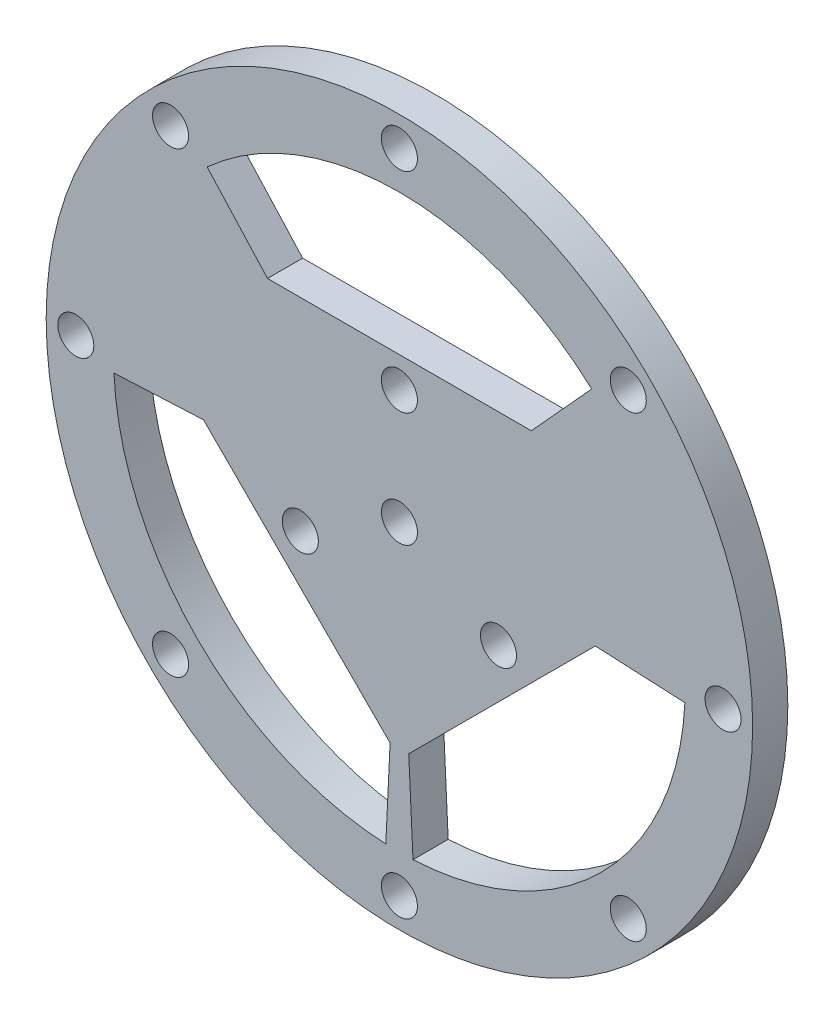
ISO-10303-21;
HEADER;
FILE_DESCRIPTION(('STEP AP214'),'2;1');
FILE_NAME('part.step','',(''),(''),'','','');
FILE_SCHEMA(('AUTOMOTIVE_DESIGN { 1 0 10303 214 1 1 1 1 }'));
ENDSEC;
DATA;
#1=APPLICATION_CONTEXT('core data for automotive mechanical design processes');
#2=APPLICATION_PROTOCOL_DEFINITION('international standard','automotive_design',2000,#1);
#3=PRODUCT_CONTEXT('',#1,'mechanical');
#4=PRODUCT('Part','Part','',(#3));
#5=PRODUCT_RELATED_PRODUCT_CATEGORY('part','',(#4));
#6=PRODUCT_DEFINITION_FORMATION('','',#4);
#7=PRODUCT_DEFINITION_CONTEXT('part definition',#1,'design');
#8=PRODUCT_DEFINITION('design','',#6,#7);
#9=PRODUCT_DEFINITION_SHAPE('','',#8);
#10=(LENGTH_UNIT() NAMED_UNIT(*) SI_UNIT(.MILLI.,.METRE.));
#11=(NAMED_UNIT(*) PLANE_ANGLE_UNIT() SI_UNIT($,.RADIAN.));
#12=(NAMED_UNIT(*) SI_UNIT($,.STERADIAN.) SOLID_ANGLE_UNIT());
#13=UNCERTAINTY_MEASURE_WITH_UNIT(LENGTH_MEASURE(1.E-05),#10,'distance_accuracy_value','');
#14=(GEOMETRIC_REPRESENTATION_CONTEXT(3) GLOBAL_UNCERTAINTY_ASSIGNED_CONTEXT((#13)) GLOBAL_UNIT_ASSIGNED_CONTEXT((#10,
#11,#12)) REPRESENTATION_CONTEXT('',''));
#15=CARTESIAN_POINT('',(0.,0.,0.));
#16=DIRECTION('',(0.,0.,1.));
#17=DIRECTION('',(1.,0.,0.));
#18=AXIS2_PLACEMENT_3D('',#15,#16,#17);
#19=CARTESIAN_POINT('',(0.,0.,8.));
#20=DIRECTION('',(-0.0475651494154486,-0.998868137724437,0.));
#21=DIRECTION('',(0.998868137724438,-0.0475651494154486,0.));
#22=AXIS2_PLACEMENT_3D('',#19,#20,#21);
#23=PLANE('',#22);
#24=DIRECTION('',(-0.998868137724438,0.0475651494154486,0.));
#25=VECTOR('',#24,1.);
#26=CARTESIAN_POINT('',(0.,0.,0.));
#27=LINE('',#26,#25);
#28=CARTESIAN_POINT('',(64.9264289520884,-3.09173471200416,0.));
#29=VERTEX_POINT('',#28);
#30=CARTESIAN_POINT('',(44.5477272147525,-2.12132034355962,0.));
#31=VERTEX_POINT('',#30);
#32=EDGE_CURVE('E247',#29,#31,#27,.T.);
#33=ORIENTED_EDGE('',*,*,#32,.F.);
#34=DIRECTION('',(0.,0.,-1.));
#35=VECTOR('',#34,1.);
#36=CARTESIAN_POINT('',(64.9264289520884,-3.09173471200416,8.));
#37=LINE('',#36,#35);
#38=CARTESIAN_POINT('',(64.9264289520884,-3.09173471200416,8.));
#39=VERTEX_POINT('',#38);
#40=EDGE_CURVE('E11',#39,#29,#37,.T.);
#41=ORIENTED_EDGE('',*,*,#40,.F.);
#42=DIRECTION('',(-0.998868137724438,0.0475651494154486,0.));
#43=VECTOR('',#42,1.);
#44=CARTESIAN_POINT('',(0.,0.,8.));
#45=LINE('',#44,#43);
#46=CARTESIAN_POINT('',(44.5477272147525,-2.12132034355962,8.));
#47=VERTEX_POINT('',#46);
#48=EDGE_CURVE('E155',#39,#47,#45,.T.);
#49=ORIENTED_EDGE('',*,*,#48,.T.);
#50=DIRECTION('',(0.,0.,-1.));
#51=VECTOR('',#50,1.);
#52=CARTESIAN_POINT('',(44.5477272147525,-2.12132034355962,8.));
#53=LINE('',#52,#51);
#54=EDGE_CURVE('E107',#47,#31,#53,.T.);
#55=ORIENTED_EDGE('',*,*,#54,.T.);
#56=EDGE_LOOP('',(#33,#41,#49,#55));
#57=FACE_BOUND('',#56,.T.);
#58=ADVANCED_FACE('F41',(#57),#23,.T.);
#59=CARTESIAN_POINT('',(0.,0.,8.));
#60=DIRECTION('',(0.,0.,-1.));
#61=DIRECTION('',(-1.,0.,0.));
#62=AXIS2_PLACEMENT_3D('',#59,#60,#61);
#63=CYLINDRICAL_SURFACE('',#62,65.);
#64=CARTESIAN_POINT('',(0.,0.,0.));
#65=DIRECTION('',(0.,0.,1.));
#66=DIRECTION('',(1.,0.,0.));
#67=AXIS2_PLACEMENT_3D('',#64,#65,#66);
#68=CIRCLE('',#67,65.);
#69=CARTESIAN_POINT('',(3.09173471200424,-64.9264289520884,0.));
#70=VERTEX_POINT('',#69);
#71=EDGE_CURVE('E161',#29,#70,#68,.F.);
#72=ORIENTED_EDGE('',*,*,#71,.T.);
#73=DIRECTION('',(0.,0.,-1.));
#74=VECTOR('',#73,1.);
#75=CARTESIAN_POINT('',(3.09173471200424,-64.9264289520884,8.));
#76=LINE('',#75,#74);
#77=CARTESIAN_POINT('',(3.09173471200424,-64.9264289520884,8.));
#78=VERTEX_POINT('',#77);
#79=EDGE_CURVE('E52',#78,#70,#76,.T.);
#80=ORIENTED_EDGE('',*,*,#79,.F.);
#81=CARTESIAN_POINT('',(0.,0.,8.));
#82=DIRECTION('',(0.,0.,1.));
#83=DIRECTION('',(1.,0.,0.));
#84=AXIS2_PLACEMENT_3D('',#81,#82,#83);
#85=CIRCLE('',#84,65.);
#86=EDGE_CURVE('E151',#39,#78,#85,.F.);
#87=ORIENTED_EDGE('',*,*,#86,.F.);
#88=ORIENTED_EDGE('',*,*,#40,.T.);
#89=EDGE_LOOP('',(#72,#80,#87,#88));
#90=FACE_BOUND('',#89,.T.);
#91=ADVANCED_FACE('F159',(#90),#63,.F.);
#92=CARTESIAN_POINT('',(0.,0.,8.));
#93=DIRECTION('',(-0.998868137724437,-0.0475651494154499,0.));
#94=DIRECTION('',(0.0475651494154499,-0.998868137724438,0.));
#95=AXIS2_PLACEMENT_3D('',#92,#93,#94);
#96=PLANE('',#95);
#97=DIRECTION('',(-0.0475651494154499,0.998868137724438,0.));
#98=VECTOR('',#97,1.);
#99=CARTESIAN_POINT('',(0.,0.,0.));
#100=LINE('',#99,#98);
#101=CARTESIAN_POINT('',(2.12132034355966,-44.5477272147525,0.));
#102=VERTEX_POINT('',#101);
#103=EDGE_CURVE('E252',#70,#102,#100,.T.);
#104=ORIENTED_EDGE('',*,*,#103,.T.);
#105=DIRECTION('',(0.,0.,-1.));
#106=VECTOR('',#105,1.);
#107=CARTESIAN_POINT('',(2.12132034355966,-44.5477272147525,8.));
#108=LINE('',#107,#106);
#109=CARTESIAN_POINT('',(2.12132034355966,-44.5477272147525,8.));
#110=VERTEX_POINT('',#109);
#111=EDGE_CURVE('E149',#110,#102,#108,.T.);
#112=ORIENTED_EDGE('',*,*,#111,.F.);
#113=DIRECTION('',(-0.0475651494154499,0.998868137724438,0.));
#114=VECTOR('',#113,1.);
#115=CARTESIAN_POINT('',(0.,0.,8.));
#116=LINE('',#115,#114);
#117=EDGE_CURVE('E143',#78,#110,#116,.T.);
#118=ORIENTED_EDGE('',*,*,#117,.F.);
#119=ORIENTED_EDGE('',*,*,#79,.T.);
#120=EDGE_LOOP('',(#104,#112,#118,#119));
#121=FACE_BOUND('',#120,.T.);
#122=ADVANCED_FACE('F146',(#121),#96,.F.);
#123=CARTESIAN_POINT('',(0.,0.,8.));
#124=DIRECTION('',(0.,0.,-1.));
#125=DIRECTION('',(-1.,0.,0.));
#126=AXIS2_PLACEMENT_3D('',#123,#124,#125);
#127=CYLINDRICAL_SURFACE('',#126,65.);
#128=CARTESIAN_POINT('',(0.,0.,0.));
#129=DIRECTION('',(0.,0.,1.));
#130=DIRECTION('',(1.,0.,0.));
#131=AXIS2_PLACEMENT_3D('',#128,#129,#130);
#132=CIRCLE('',#131,65.);
#133=CARTESIAN_POINT('',(-64.9264289520884,-3.09173471200414,0.));
#134=VERTEX_POINT('',#133);
#135=CARTESIAN_POINT('',(-3.09173471200426,-64.9264289520885,0.));
#136=VERTEX_POINT('',#135);
#137=EDGE_CURVE('E227',#134,#136,#132,.T.);
#138=ORIENTED_EDGE('',*,*,#137,.F.);
#139=DIRECTION('',(0.,0.,-1.));
#140=VECTOR('',#139,1.);
#141=CARTESIAN_POINT('',(-64.9264289520884,-3.09173471200414,8.));
#142=LINE('',#141,#140);
#143=CARTESIAN_POINT('',(-64.9264289520884,-3.09173471200414,8.));
#144=VERTEX_POINT('',#143);
#145=EDGE_CURVE('E177',#144,#134,#142,.T.);
#146=ORIENTED_EDGE('',*,*,#145,.F.);
#147=CARTESIAN_POINT('',(0.,0.,8.));
#148=DIRECTION('',(0.,0.,1.));
#149=DIRECTION('',(1.,0.,0.));
#150=AXIS2_PLACEMENT_3D('',#147,#148,#149);
#151=CIRCLE('',#150,65.);
#152=CARTESIAN_POINT('',(-3.09173471200426,-64.9264289520885,8.));
#153=VERTEX_POINT('',#152);
#154=EDGE_CURVE('E320',#144,#153,#151,.T.);
#155=ORIENTED_EDGE('',*,*,#154,.T.);
#156=DIRECTION('',(0.,0.,-1.));
#157=VECTOR('',#156,1.);
#158=CARTESIAN_POINT('',(-3.09173471200426,-64.9264289520885,8.));
#159=LINE('',#158,#157);
#160=EDGE_CURVE('E168',#153,#136,#159,.T.);
#161=ORIENTED_EDGE('',*,*,#160,.T.);
#162=EDGE_LOOP('',(#138,#146,#155,#161));
#163=FACE_BOUND('',#162,.T.);
#164=ADVANCED_FACE('F426',(#163),#127,.F.);
#165=CARTESIAN_POINT('',(0.,0.,8.));
#166=DIRECTION('',(-0.0475651494154484,0.998868137724438,0.));
#167=DIRECTION('',(-0.998868137724438,-0.0475651494154484,0.));
#168=AXIS2_PLACEMENT_3D('',#165,#166,#167);
#169=PLANE('',#168);
#170=DIRECTION('',(0.998868137724438,0.0475651494154484,0.));
#171=VECTOR('',#170,1.);
#172=CARTESIAN_POINT('',(0.,0.,0.));
#173=LINE('',#172,#171);
#174=CARTESIAN_POINT('',(-44.5477272147525,-2.1213203435596,0.));
#175=VERTEX_POINT('',#174);
#176=EDGE_CURVE('E231',#134,#175,#173,.T.);
#177=ORIENTED_EDGE('',*,*,#176,.T.);
#178=DIRECTION('',(0.,0.,-1.));
#179=VECTOR('',#178,1.);
#180=CARTESIAN_POINT('',(-44.5477272147525,-2.1213203435596,8.));
#181=LINE('',#180,#179);
#182=CARTESIAN_POINT('',(-44.5477272147525,-2.1213203435596,8.));
#183=VERTEX_POINT('',#182);
#184=EDGE_CURVE('E174',#183,#175,#181,.T.);
#185=ORIENTED_EDGE('',*,*,#184,.F.);
#186=DIRECTION('',(0.998868137724438,0.0475651494154484,0.));
#187=VECTOR('',#186,1.);
#188=CARTESIAN_POINT('',(0.,0.,8.));
#189=LINE('',#188,#187);
#190=EDGE_CURVE('E324',#144,#183,#189,.T.);
#191=ORIENTED_EDGE('',*,*,#190,.F.);
#192=ORIENTED_EDGE('',*,*,#145,.T.);
#193=EDGE_LOOP('',(#177,#185,#191,#192));
#194=FACE_BOUND('',#193,.T.);
#195=ADVANCED_FACE('F422',(#194),#169,.F.);
#196=CARTESIAN_POINT('',(-23.3345237791561,-23.334523779156,8.));
#197=DIRECTION('',(-0.707106781186548,-0.707106781186547,0.));
#198=DIRECTION('',(0.707106781186547,-0.707106781186548,0.));
#199=AXIS2_PLACEMENT_3D('',#196,#197,#198);
#200=PLANE('',#199);
#201=DIRECTION('',(-0.707106781186547,0.707106781186548,0.));
#202=VECTOR('',#201,1.);
#203=CARTESIAN_POINT('',(-23.3345237791561,-23.334523779156,0.));
#204=LINE('',#203,#202);
#205=CARTESIAN_POINT('',(-2.12132034355969,-44.5477272147525,0.));
#206=VERTEX_POINT('',#205);
#207=EDGE_CURVE('E235',#206,#175,#204,.T.);
#208=ORIENTED_EDGE('',*,*,#207,.F.);
#209=DIRECTION('',(0.,0.,-1.));
#210=VECTOR('',#209,1.);
#211=CARTESIAN_POINT('',(-2.12132034355969,-44.5477272147525,8.));
#212=LINE('',#211,#210);
#213=CARTESIAN_POINT('',(-2.12132034355969,-44.5477272147525,8.));
#214=VERTEX_POINT('',#213);
#215=EDGE_CURVE('E171',#214,#206,#212,.T.);
#216=ORIENTED_EDGE('',*,*,#215,.F.);
#217=DIRECTION('',(-0.707106781186547,0.707106781186548,0.));
#218=VECTOR('',#217,1.);
#219=CARTESIAN_POINT('',(-23.3345237791561,-23.334523779156,8.));
#220=LINE('',#219,#218);
#221=EDGE_CURVE('E327',#214,#183,#220,.T.);
#222=ORIENTED_EDGE('',*,*,#221,.T.);
#223=ORIENTED_EDGE('',*,*,#184,.T.);
#224=EDGE_LOOP('',(#208,#216,#222,#223));
#225=FACE_BOUND('',#224,.T.);
#226=ADVANCED_FACE('F419',(#225),#200,.T.);
#227=CARTESIAN_POINT('',(0.,0.,8.));
#228=DIRECTION('',(0.739940073395944,-0.672672793996313,0.));
#229=DIRECTION('',(0.672672793996313,0.739940073395944,0.));
#230=AXIS2_PLACEMENT_3D('',#227,#228,#229);
#231=PLANE('',#230);
#232=DIRECTION('',(-0.672672793996313,-0.739940073395944,0.));
#233=VECTOR('',#232,1.);
#234=CARTESIAN_POINT('',(0.,0.,0.));
#235=LINE('',#234,#233);
#236=CARTESIAN_POINT('',(43.7237316097603,48.0961047707363,0.));
#237=VERTEX_POINT('',#236);
#238=CARTESIAN_POINT('',(30.,33.,0.));
#239=VERTEX_POINT('',#238);
#240=EDGE_CURVE('E201',#237,#239,#235,.T.);
#241=ORIENTED_EDGE('',*,*,#240,.T.);
#242=DIRECTION('',(0.,0.,-1.));
#243=VECTOR('',#242,1.);
#244=CARTESIAN_POINT('',(30.,33.,8.));
#245=LINE('',#244,#243);
#246=CARTESIAN_POINT('',(30.,33.,8.));
#247=VERTEX_POINT('',#246);
#248=EDGE_CURVE('E45',#247,#239,#245,.T.);
#249=ORIENTED_EDGE('',*,*,#248,.F.);
#250=DIRECTION('',(-0.672672793996313,-0.739940073395944,0.));
#251=VECTOR('',#250,1.);
#252=CARTESIAN_POINT('',(0.,0.,8.));
#253=LINE('',#252,#251);
#254=CARTESIAN_POINT('',(43.7237316097603,48.0961047707363,8.));
#255=VERTEX_POINT('',#254);
#256=EDGE_CURVE('E305',#255,#247,#253,.T.);
#257=ORIENTED_EDGE('',*,*,#256,.F.);
#258=DIRECTION('',(0.,0.,-1.));
#259=VECTOR('',#258,1.);
#260=CARTESIAN_POINT('',(43.7237316097603,48.0961047707363,8.));
#261=LINE('',#260,#259);
#262=EDGE_CURVE('E180',#255,#237,#261,.T.);
#263=ORIENTED_EDGE('',*,*,#262,.T.);
#264=EDGE_LOOP('',(#241,#249,#257,#263));
#265=FACE_BOUND('',#264,.T.);
#266=ADVANCED_FACE('F202',(#265),#231,.F.);
#267=CARTESIAN_POINT('',(0.,33.,8.));
#268=DIRECTION('',(0.,-1.,0.));
#269=DIRECTION('',(0.,0.,-1.));
#270=AXIS2_PLACEMENT_3D('',#267,#268,#269);
#271=PLANE('',#270);
#272=DIRECTION('',(-1.,0.,0.));
#273=VECTOR('',#272,1.);
#274=CARTESIAN_POINT('',(0.,33.,0.));
#275=LINE('',#274,#273);
#276=CARTESIAN_POINT('',(-30.,33.,0.));
#277=VERTEX_POINT('',#276);
#278=EDGE_CURVE('E196',#239,#277,#275,.T.);
#279=ORIENTED_EDGE('',*,*,#278,.T.);
#280=DIRECTION('',(0.,0.,-1.));
#281=VECTOR('',#280,1.);
#282=CARTESIAN_POINT('',(-30.,33.,8.));
#283=LINE('',#282,#281);
#284=CARTESIAN_POINT('',(-30.,33.,8.));
#285=VERTEX_POINT('',#284);
#286=EDGE_CURVE('E186',#285,#277,#283,.T.);
#287=ORIENTED_EDGE('',*,*,#286,.F.);
#288=DIRECTION('',(-1.,0.,0.));
#289=VECTOR('',#288,1.);
#290=CARTESIAN_POINT('',(0.,33.,8.));
#291=LINE('',#290,#289);
#292=EDGE_CURVE('E115',#247,#285,#291,.T.);
#293=ORIENTED_EDGE('',*,*,#292,.F.);
#294=ORIENTED_EDGE('',*,*,#248,.T.);
#295=EDGE_LOOP('',(#279,#287,#293,#294));
#296=FACE_BOUND('',#295,.T.);
#297=ADVANCED_FACE('F195',(#296),#271,.F.);
#298=CARTESIAN_POINT('',(0.,0.,8.));
#299=DIRECTION('',(0.739940073395944,0.672672793996313,0.));
#300=DIRECTION('',(-0.672672793996313,0.739940073395944,0.));
#301=AXIS2_PLACEMENT_3D('',#298,#299,#300);
#302=PLANE('',#301);
#303=DIRECTION('',(0.672672793996313,-0.739940073395944,0.));
#304=VECTOR('',#303,1.);
#305=CARTESIAN_POINT('',(0.,0.,0.));
#306=LINE('',#305,#304);
#307=CARTESIAN_POINT('',(-43.7237316097603,48.0961047707363,0.));
#308=VERTEX_POINT('',#307);
#309=EDGE_CURVE('E211',#308,#277,#306,.T.);
#310=ORIENTED_EDGE('',*,*,#309,.F.);
#311=DIRECTION('',(0.,0.,-1.));
#312=VECTOR('',#311,1.);
#313=CARTESIAN_POINT('',(-43.7237316097603,48.0961047707363,8.));
#314=LINE('',#313,#312);
#315=CARTESIAN_POINT('',(-43.7237316097603,48.0961047707363,8.));
#316=VERTEX_POINT('',#315);
#317=EDGE_CURVE('E184',#316,#308,#314,.T.);
#318=ORIENTED_EDGE('',*,*,#317,.F.);
#319=DIRECTION('',(0.672672793996313,-0.739940073395944,0.));
#320=VECTOR('',#319,1.);
#321=CARTESIAN_POINT('',(0.,0.,8.));
#322=LINE('',#321,#320);
#323=EDGE_CURVE('E310',#316,#285,#322,.T.);
#324=ORIENTED_EDGE('',*,*,#323,.T.);
#325=ORIENTED_EDGE('',*,*,#286,.T.);
#326=EDGE_LOOP('',(#310,#318,#324,#325));
#327=FACE_BOUND('',#326,.T.);
#328=ADVANCED_FACE('F413',(#327),#302,.T.);
#329=CARTESIAN_POINT('',(0.,0.,8.));
#330=DIRECTION('',(0.,0.,-1.));
#331=DIRECTION('',(-1.,0.,0.));
#332=AXIS2_PLACEMENT_3D('',#329,#330,#331);
#333=CYLINDRICAL_SURFACE('',#332,80.3371303603681);
#334=CARTESIAN_POINT('',(0.,0.,8.));
#335=DIRECTION('',(0.,0.,1.));
#336=DIRECTION('',(1.,0.,0.));
#337=AXIS2_PLACEMENT_3D('',#334,#335,#336);
#338=CIRCLE('',#337,80.3371303603681);
#339=CARTESIAN_POINT('',(80.3371303603681,0.,8.));
#340=VERTEX_POINT('',#339);
#341=EDGE_CURVE('E335',#340,#340,#338,.T.);
#342=ORIENTED_EDGE('',*,*,#341,.F.);
#343=EDGE_LOOP('',(#342));
#344=FACE_BOUND('',#343,.T.);
#345=CARTESIAN_POINT('',(0.,0.,0.));
#346=DIRECTION('',(0.,0.,1.));
#347=DIRECTION('',(1.,0.,0.));
#348=AXIS2_PLACEMENT_3D('',#345,#346,#347);
#349=CIRCLE('',#348,80.3371303603681);
#350=CARTESIAN_POINT('',(80.3371303603681,0.,0.));
#351=VERTEX_POINT('',#350);
#352=EDGE_CURVE('E243',#351,#351,#349,.T.);
#353=ORIENTED_EDGE('',*,*,#352,.T.);
#354=EDGE_LOOP('',(#353));
#355=FACE_BOUND('',#354,.T.);
#356=ADVANCED_FACE('F409',(#344,#355),#333,.T.);
#357=CARTESIAN_POINT('',(0.,0.,8.));
#358=DIRECTION('',(-0.998868137724437,0.0475651494154501,0.));
#359=DIRECTION('',(-0.0475651494154501,-0.998868137724437,0.));
#360=AXIS2_PLACEMENT_3D('',#357,#358,#359);
#361=PLANE('',#360);
#362=DIRECTION('',(0.0475651494154501,0.998868137724437,0.));
#363=VECTOR('',#362,1.);
#364=CARTESIAN_POINT('',(0.,0.,0.));
#365=LINE('',#364,#363);
#366=EDGE_CURVE('E239',#136,#206,#365,.T.);
#367=ORIENTED_EDGE('',*,*,#366,.F.);
#368=ORIENTED_EDGE('',*,*,#160,.F.);
#369=DIRECTION('',(0.0475651494154501,0.998868137724437,0.));
#370=VECTOR('',#369,1.);
#371=CARTESIAN_POINT('',(0.,0.,8.));
#372=LINE('',#371,#370);
#373=EDGE_CURVE('E331',#153,#214,#372,.T.);
#374=ORIENTED_EDGE('',*,*,#373,.T.);
#375=ORIENTED_EDGE('',*,*,#215,.T.);
#376=EDGE_LOOP('',(#367,#368,#374,#375));
#377=FACE_BOUND('',#376,.T.);
#378=ADVANCED_FACE('F412',(#377),#361,.T.);
#379=CARTESIAN_POINT('',(-52.0449468016522,52.0449468016523,8.));
#380=DIRECTION('',(0.,0.,-1.));
#381=DIRECTION('',(-1.,0.,0.));
#382=AXIS2_PLACEMENT_3D('',#379,#380,#381);
#383=CYLINDRICAL_SURFACE('',#382,4.09999999999927);
#384=CARTESIAN_POINT('',(-52.0449468016522,52.0449468016523,8.));
#385=DIRECTION('',(0.,0.,1.));
#386=DIRECTION('',(1.,0.,0.));
#387=AXIS2_PLACEMENT_3D('',#384,#385,#386);
#388=CIRCLE('',#387,4.09999999999927);
#389=CARTESIAN_POINT('',(-47.9449468016529,52.0449468016523,8.));
#390=VERTEX_POINT('',#389);
#391=EDGE_CURVE('E316',#390,#390,#388,.T.);
#392=ORIENTED_EDGE('',*,*,#391,.T.);
#393=EDGE_LOOP('',(#392));
#394=FACE_BOUND('',#393,.T.);
#395=CARTESIAN_POINT('',(-52.0449468016522,52.0449468016523,0.));
#396=DIRECTION('',(0.,0.,1.));
#397=DIRECTION('',(1.,0.,0.));
#398=AXIS2_PLACEMENT_3D('',#395,#396,#397);
#399=CIRCLE('',#398,4.09999999999927);
#400=CARTESIAN_POINT('',(-47.9449468016529,52.0449468016523,0.));
#401=VERTEX_POINT('',#400);
#402=EDGE_CURVE('E223',#401,#401,#399,.T.);
#403=ORIENTED_EDGE('',*,*,#402,.F.);
#404=EDGE_LOOP('',(#403));
#405=FACE_BOUND('',#404,.T.);
#406=ADVANCED_FACE('F417',(#394,#405),#383,.F.);
#407=CARTESIAN_POINT('',(0.,0.,8.));
#408=DIRECTION('',(0.,0.,-1.));
#409=DIRECTION('',(-1.,0.,0.));
#410=AXIS2_PLACEMENT_3D('',#407,#408,#409);
#411=CYLINDRICAL_SURFACE('',#410,65.);
#412=CARTESIAN_POINT('',(0.,0.,0.));
#413=DIRECTION('',(0.,0.,1.));
#414=DIRECTION('',(1.,0.,0.));
#415=AXIS2_PLACEMENT_3D('',#412,#413,#414);
#416=CIRCLE('',#415,65.);
#417=EDGE_CURVE('E220',#308,#237,#416,.F.);
#418=ORIENTED_EDGE('',*,*,#417,.T.);
#419=ORIENTED_EDGE('',*,*,#262,.F.);
#420=CARTESIAN_POINT('',(0.,0.,8.));
#421=DIRECTION('',(0.,0.,1.));
#422=DIRECTION('',(1.,0.,0.));
#423=AXIS2_PLACEMENT_3D('',#420,#421,#422);
#424=CIRCLE('',#423,65.);
#425=EDGE_CURVE('E313',#316,#255,#424,.F.);
#426=ORIENTED_EDGE('',*,*,#425,.F.);
#427=ORIENTED_EDGE('',*,*,#317,.T.);
#428=EDGE_LOOP('',(#418,#419,#426,#427));
#429=FACE_BOUND('',#428,.T.);
#430=ADVANCED_FACE('F398',(#429),#411,.F.);
#431=CARTESIAN_POINT('',(0.,-73.6026696198828,8.));
#432=DIRECTION('',(0.,0.,-1.));
#433=DIRECTION('',(-1.,0.,0.));
#434=AXIS2_PLACEMENT_3D('',#431,#432,#433);
#435=CYLINDRICAL_SURFACE('',#434,4.1000000000008);
#436=CARTESIAN_POINT('',(0.,-73.6026696198828,8.));
#437=DIRECTION('',(0.,0.,1.));
#438=DIRECTION('',(1.,0.,0.));
#439=AXIS2_PLACEMENT_3D('',#436,#437,#438);
#440=CIRCLE('',#439,4.1000000000008);
#441=CARTESIAN_POINT('',(4.10000000000079,-73.6026696198828,8.));
#442=VERTEX_POINT('',#441);
#443=EDGE_CURVE('E301',#442,#442,#440,.T.);
#444=ORIENTED_EDGE('',*,*,#443,.T.);
#445=EDGE_LOOP('',(#444));
#446=FACE_BOUND('',#445,.T.);
#447=CARTESIAN_POINT('',(0.,-73.6026696198828,0.));
#448=DIRECTION('',(0.,0.,1.));
#449=DIRECTION('',(1.,0.,0.));
#450=AXIS2_PLACEMENT_3D('',#447,#448,#449);
#451=CIRCLE('',#450,4.1000000000008);
#452=CARTESIAN_POINT('',(4.10000000000079,-73.6026696198828,0.));
#453=VERTEX_POINT('',#452);
#454=EDGE_CURVE('E207',#453,#453,#451,.T.);
#455=ORIENTED_EDGE('',*,*,#454,.F.);
#456=EDGE_LOOP('',(#455));
#457=FACE_BOUND('',#456,.T.);
#458=ADVANCED_FACE('F388',(#446,#457),#435,.F.);
#459=CARTESIAN_POINT('',(-52.0449468016522,-52.0449468016522,8.));
#460=DIRECTION('',(0.,0.,-1.));
#461=DIRECTION('',(-1.,0.,0.));
#462=AXIS2_PLACEMENT_3D('',#459,#460,#461);
#463=CYLINDRICAL_SURFACE('',#462,4.1000000000004);
#464=CARTESIAN_POINT('',(-52.0449468016522,-52.0449468016522,8.));
#465=DIRECTION('',(0.,0.,1.));
#466=DIRECTION('',(1.,0.,0.));
#467=AXIS2_PLACEMENT_3D('',#464,#465,#466);
#468=CIRCLE('',#467,4.1000000000004);
#469=CARTESIAN_POINT('',(-47.9449468016518,-52.0449468016522,8.));
#470=VERTEX_POINT('',#469);
#471=EDGE_CURVE('E297',#470,#470,#468,.T.);
#472=ORIENTED_EDGE('',*,*,#471,.T.);
#473=EDGE_LOOP('',(#472));
#474=FACE_BOUND('',#473,.T.);
#475=CARTESIAN_POINT('',(-52.0449468016522,-52.0449468016522,0.));
#476=DIRECTION('',(0.,0.,1.));
#477=DIRECTION('',(1.,0.,0.));
#478=AXIS2_PLACEMENT_3D('',#475,#476,#477);
#479=CIRCLE('',#478,4.1000000000004);
#480=CARTESIAN_POINT('',(-47.9449468016518,-52.0449468016522,0.));
#481=VERTEX_POINT('',#480);
#482=EDGE_CURVE('E214',#481,#481,#479,.T.);
#483=ORIENTED_EDGE('',*,*,#482,.F.);
#484=EDGE_LOOP('',(#483));
#485=FACE_BOUND('',#484,.T.);
#486=ADVANCED_FACE('F385',(#474,#485),#463,.F.);
#487=CARTESIAN_POINT('',(-73.6026696198828,0.,8.));
#488=DIRECTION('',(0.,0.,-1.));
#489=DIRECTION('',(-1.,0.,0.));
#490=AXIS2_PLACEMENT_3D('',#487,#488,#489);
#491=CYLINDRICAL_SURFACE('',#490,4.09999999999975);
#492=CARTESIAN_POINT('',(-73.6026696198828,0.,8.));
#493=DIRECTION('',(0.,0.,1.));
#494=DIRECTION('',(1.,0.,0.));
#495=AXIS2_PLACEMENT_3D('',#492,#493,#494);
#496=CIRCLE('',#495,4.09999999999975);
#497=CARTESIAN_POINT('',(-69.502669619883,0.,8.));
#498=VERTEX_POINT('',#497);
#499=EDGE_CURVE('E293',#498,#498,#496,.T.);
#500=ORIENTED_EDGE('',*,*,#499,.T.);
#501=EDGE_LOOP('',(#500));
#502=FACE_BOUND('',#501,.T.);
#503=CARTESIAN_POINT('',(-73.6026696198828,0.,0.));
#504=DIRECTION('',(0.,0.,1.));
#505=DIRECTION('',(1.,0.,0.));
#506=AXIS2_PLACEMENT_3D('',#503,#504,#505);
#507=CIRCLE('',#506,4.09999999999975);
#508=CARTESIAN_POINT('',(-69.502669619883,0.,0.));
#509=VERTEX_POINT('',#508);
#510=EDGE_CURVE('E375',#509,#509,#507,.T.);
#511=ORIENTED_EDGE('',*,*,#510,.F.);
#512=EDGE_LOOP('',(#511));
#513=FACE_BOUND('',#512,.T.);
#514=ADVANCED_FACE('F387',(#502,#513),#491,.F.);
#515=CARTESIAN_POINT('',(-22.53612303442,-13.0112367004134,8.));
#516=DIRECTION('',(0.,0.,-1.));
#517=DIRECTION('',(-1.,0.,0.));
#518=AXIS2_PLACEMENT_3D('',#515,#516,#517);
#519=CYLINDRICAL_SURFACE('',#518,4.1);
#520=CARTESIAN_POINT('',(-22.53612303442,-13.0112367004134,8.));
#521=DIRECTION('',(0.,0.,1.));
#522=DIRECTION('',(1.,0.,0.));
#523=AXIS2_PLACEMENT_3D('',#520,#521,#522);
#524=CIRCLE('',#523,4.1);
#525=CARTESIAN_POINT('',(-18.43612303442,-13.0112367004134,8.));
#526=VERTEX_POINT('',#525);
#527=EDGE_CURVE('E289',#526,#526,#524,.T.);
#528=ORIENTED_EDGE('',*,*,#527,.T.);
#529=EDGE_LOOP('',(#528));
#530=FACE_BOUND('',#529,.T.);
#531=CARTESIAN_POINT('',(-22.53612303442,-13.0112367004134,0.));
#532=DIRECTION('',(0.,0.,1.));
#533=DIRECTION('',(1.,0.,0.));
#534=AXIS2_PLACEMENT_3D('',#531,#532,#533);
#535=CIRCLE('',#534,4.1);
#536=CARTESIAN_POINT('',(-18.43612303442,-13.0112367004134,0.));
#537=VERTEX_POINT('',#536);
#538=EDGE_CURVE('E371',#537,#537,#535,.T.);
#539=ORIENTED_EDGE('',*,*,#538,.F.);
#540=EDGE_LOOP('',(#539));
#541=FACE_BOUND('',#540,.T.);
#542=ADVANCED_FACE('F395',(#530,#541),#519,.F.);
#543=CARTESIAN_POINT('',(0.,73.6026696198828,8.));
#544=DIRECTION('',(0.,0.,-1.));
#545=DIRECTION('',(-1.,0.,0.));
#546=AXIS2_PLACEMENT_3D('',#543,#544,#545);
#547=CYLINDRICAL_SURFACE('',#546,4.09999999999923);
#548=CARTESIAN_POINT('',(0.,73.6026696198828,8.));
#549=DIRECTION('',(0.,0.,1.));
#550=DIRECTION('',(1.,0.,0.));
#551=AXIS2_PLACEMENT_3D('',#548,#549,#550);
#552=CIRCLE('',#551,4.09999999999923);
#553=CARTESIAN_POINT('',(4.09999999999923,73.6026696198828,8.));
#554=VERTEX_POINT('',#553);
#555=EDGE_CURVE('E285',#554,#554,#552,.T.);
#556=ORIENTED_EDGE('',*,*,#555,.T.);
#557=EDGE_LOOP('',(#556));
#558=FACE_BOUND('',#557,.T.);
#559=CARTESIAN_POINT('',(0.,73.6026696198828,0.));
#560=DIRECTION('',(0.,0.,1.));
#561=DIRECTION('',(1.,0.,0.));
#562=AXIS2_PLACEMENT_3D('',#559,#560,#561);
#563=CIRCLE('',#562,4.09999999999923);
#564=CARTESIAN_POINT('',(4.09999999999923,73.6026696198828,0.));
#565=VERTEX_POINT('',#564);
#566=EDGE_CURVE('E367',#565,#565,#563,.T.);
#567=ORIENTED_EDGE('',*,*,#566,.F.);
#568=EDGE_LOOP('',(#567));
#569=FACE_BOUND('',#568,.T.);
#570=ADVANCED_FACE('F493',(#558,#569),#547,.F.);
#571=CARTESIAN_POINT('',(52.0449468016522,-52.0449468016522,8.));
#572=DIRECTION('',(0.,0.,-1.));
#573=DIRECTION('',(-1.,0.,0.));
#574=AXIS2_PLACEMENT_3D('',#571,#572,#573);
#575=CYLINDRICAL_SURFACE('',#574,4.10000000000075);
#576=CARTESIAN_POINT('',(52.0449468016522,-52.0449468016522,8.));
#577=DIRECTION('',(0.,0.,1.));
#578=DIRECTION('',(1.,0.,0.));
#579=AXIS2_PLACEMENT_3D('',#576,#577,#578);
#580=CIRCLE('',#579,4.10000000000075);
#581=CARTESIAN_POINT('',(56.1449468016529,-52.0449468016522,8.));
#582=VERTEX_POINT('',#581);
#583=EDGE_CURVE('E281',#582,#582,#580,.T.);
#584=ORIENTED_EDGE('',*,*,#583,.T.);
#585=EDGE_LOOP('',(#584));
#586=FACE_BOUND('',#585,.T.);
#587=CARTESIAN_POINT('',(52.0449468016522,-52.0449468016522,0.));
#588=DIRECTION('',(0.,0.,1.));
#589=DIRECTION('',(1.,0.,0.));
#590=AXIS2_PLACEMENT_3D('',#587,#588,#589);
#591=CIRCLE('',#590,4.10000000000075);
#592=CARTESIAN_POINT('',(56.1449468016529,-52.0449468016522,0.));
#593=VERTEX_POINT('',#592);
#594=EDGE_CURVE('E363',#593,#593,#591,.T.);
#595=ORIENTED_EDGE('',*,*,#594,.F.);
#596=EDGE_LOOP('',(#595));
#597=FACE_BOUND('',#596,.T.);
#598=ADVANCED_FACE('F503',(#586,#597),#575,.F.);
#599=CARTESIAN_POINT('',(73.6026696198828,0.,8.));
#600=DIRECTION('',(0.,0.,-1.));
#601=DIRECTION('',(-1.,0.,0.));
#602=AXIS2_PLACEMENT_3D('',#599,#600,#601);
#603=CYLINDRICAL_SURFACE('',#602,4.10000000000021);
#604=CARTESIAN_POINT('',(73.6026696198828,0.,8.));
#605=DIRECTION('',(0.,0.,1.));
#606=DIRECTION('',(1.,0.,0.));
#607=AXIS2_PLACEMENT_3D('',#604,#605,#606);
#608=CIRCLE('',#607,4.10000000000021);
#609=CARTESIAN_POINT('',(77.702669619883,0.,8.));
#610=VERTEX_POINT('',#609);
#611=EDGE_CURVE('E277',#610,#610,#608,.T.);
#612=ORIENTED_EDGE('',*,*,#611,.T.);
#613=EDGE_LOOP('',(#612));
#614=FACE_BOUND('',#613,.T.);
#615=CARTESIAN_POINT('',(73.6026696198828,0.,0.));
#616=DIRECTION('',(0.,0.,1.));
#617=DIRECTION('',(1.,0.,0.));
#618=AXIS2_PLACEMENT_3D('',#615,#616,#617);
#619=CIRCLE('',#618,4.10000000000021);
#620=CARTESIAN_POINT('',(77.702669619883,0.,0.));
#621=VERTEX_POINT('',#620);
#622=EDGE_CURVE('E359',#621,#621,#619,.T.);
#623=ORIENTED_EDGE('',*,*,#622,.F.);
#624=EDGE_LOOP('',(#623));
#625=FACE_BOUND('',#624,.T.);
#626=ADVANCED_FACE('F513',(#614,#625),#603,.F.);
#627=CARTESIAN_POINT('',(52.0449468016523,52.0449468016522,8.));
#628=DIRECTION('',(0.,0.,-1.));
#629=DIRECTION('',(-1.,0.,0.));
#630=AXIS2_PLACEMENT_3D('',#627,#628,#629);
#631=CYLINDRICAL_SURFACE('',#630,4.09999999999956);
#632=CARTESIAN_POINT('',(52.0449468016523,52.0449468016522,8.));
#633=DIRECTION('',(0.,0.,1.));
#634=DIRECTION('',(1.,0.,0.));
#635=AXIS2_PLACEMENT_3D('',#632,#633,#634);
#636=CIRCLE('',#635,4.09999999999956);
#637=CARTESIAN_POINT('',(56.1449468016518,52.0449468016522,8.));
#638=VERTEX_POINT('',#637);
#639=EDGE_CURVE('E273',#638,#638,#636,.T.);
#640=ORIENTED_EDGE('',*,*,#639,.T.);
#641=EDGE_LOOP('',(#640));
#642=FACE_BOUND('',#641,.T.);
#643=CARTESIAN_POINT('',(52.0449468016523,52.0449468016522,0.));
#644=DIRECTION('',(0.,0.,1.));
#645=DIRECTION('',(1.,0.,0.));
#646=AXIS2_PLACEMENT_3D('',#643,#644,#645);
#647=CIRCLE('',#646,4.09999999999956);
#648=CARTESIAN_POINT('',(56.1449468016518,52.0449468016522,0.));
#649=VERTEX_POINT('',#648);
#650=EDGE_CURVE('E355',#649,#649,#647,.T.);
#651=ORIENTED_EDGE('',*,*,#650,.F.);
#652=EDGE_LOOP('',(#651));
#653=FACE_BOUND('',#652,.T.);
#654=ADVANCED_FACE('F523',(#642,#653),#631,.F.);
#655=CARTESIAN_POINT('',(0.,0.,8.));
#656=DIRECTION('',(0.,0.,-1.));
#657=DIRECTION('',(-1.,0.,0.));
#658=AXIS2_PLACEMENT_3D('',#655,#656,#657);
#659=CYLINDRICAL_SURFACE('',#658,4.1);
#660=CARTESIAN_POINT('',(0.,0.,8.));
#661=DIRECTION('',(0.,0.,1.));
#662=DIRECTION('',(1.,0.,0.));
#663=AXIS2_PLACEMENT_3D('',#660,#661,#662);
#664=CIRCLE('',#663,4.1);
#665=CARTESIAN_POINT('',(4.1,0.,8.));
#666=VERTEX_POINT('',#665);
#667=EDGE_CURVE('E267',#666,#666,#664,.T.);
#668=ORIENTED_EDGE('',*,*,#667,.T.);
#669=EDGE_LOOP('',(#668));
#670=FACE_BOUND('',#669,.T.);
#671=CARTESIAN_POINT('',(0.,0.,0.));
#672=DIRECTION('',(0.,0.,1.));
#673=DIRECTION('',(1.,0.,0.));
#674=AXIS2_PLACEMENT_3D('',#671,#672,#673);
#675=CIRCLE('',#674,4.1);
#676=CARTESIAN_POINT('',(4.1,0.,0.));
#677=VERTEX_POINT('',#676);
#678=EDGE_CURVE('E351',#677,#677,#675,.T.);
#679=ORIENTED_EDGE('',*,*,#678,.F.);
#680=EDGE_LOOP('',(#679));
#681=FACE_BOUND('',#680,.T.);
#682=ADVANCED_FACE('F533',(#670,#681),#659,.F.);
#683=CARTESIAN_POINT('',(-2.85778511984544E-13,26.0224734008261,8.));
#684=DIRECTION('',(0.,0.,-1.));
#685=DIRECTION('',(-1.,0.,0.));
#686=AXIS2_PLACEMENT_3D('',#683,#684,#685);
#687=CYLINDRICAL_SURFACE('',#686,4.1);
#688=CARTESIAN_POINT('',(-2.85778511984544E-13,26.0224734008261,8.));
#689=DIRECTION('',(0.,0.,1.));
#690=DIRECTION('',(1.,0.,0.));
#691=AXIS2_PLACEMENT_3D('',#688,#689,#690);
#692=CIRCLE('',#691,4.1);
#693=CARTESIAN_POINT('',(4.09999999999971,26.0224734008261,8.));
#694=VERTEX_POINT('',#693);
#695=EDGE_CURVE('E261',#694,#694,#692,.T.);
#696=ORIENTED_EDGE('',*,*,#695,.T.);
#697=EDGE_LOOP('',(#696));
#698=FACE_BOUND('',#697,.T.);
#699=CARTESIAN_POINT('',(-2.85778511984544E-13,26.0224734008261,0.));
#700=DIRECTION('',(0.,0.,1.));
#701=DIRECTION('',(1.,0.,0.));
#702=AXIS2_PLACEMENT_3D('',#699,#700,#701);
#703=CIRCLE('',#702,4.1);
#704=CARTESIAN_POINT('',(4.09999999999971,26.0224734008261,0.));
#705=VERTEX_POINT('',#704);
#706=EDGE_CURVE('E347',#705,#705,#703,.T.);
#707=ORIENTED_EDGE('',*,*,#706,.F.);
#708=EDGE_LOOP('',(#707));
#709=FACE_BOUND('',#708,.T.);
#710=ADVANCED_FACE('F543',(#698,#709),#687,.F.);
#711=CARTESIAN_POINT('',(22.5361230344205,-13.0112367004126,8.));
#712=DIRECTION('',(0.,0.,-1.));
#713=DIRECTION('',(-1.,0.,0.));
#714=AXIS2_PLACEMENT_3D('',#711,#712,#713);
#715=CYLINDRICAL_SURFACE('',#714,4.1);
#716=CARTESIAN_POINT('',(22.5361230344205,-13.0112367004126,8.));
#717=DIRECTION('',(0.,0.,1.));
#718=DIRECTION('',(1.,0.,0.));
#719=AXIS2_PLACEMENT_3D('',#716,#717,#718);
#720=CIRCLE('',#719,4.1);
#721=CARTESIAN_POINT('',(26.6361230344205,-13.0112367004126,8.));
#722=VERTEX_POINT('',#721);
#723=EDGE_CURVE('E256',#722,#722,#720,.T.);
#724=ORIENTED_EDGE('',*,*,#723,.T.);
#725=EDGE_LOOP('',(#724));
#726=FACE_BOUND('',#725,.T.);
#727=CARTESIAN_POINT('',(22.5361230344205,-13.0112367004126,0.));
#728=DIRECTION('',(0.,0.,1.));
#729=DIRECTION('',(1.,0.,0.));
#730=AXIS2_PLACEMENT_3D('',#727,#728,#729);
#731=CIRCLE('',#730,4.1);
#732=CARTESIAN_POINT('',(26.6361230344205,-13.0112367004126,0.));
#733=VERTEX_POINT('',#732);
#734=EDGE_CURVE('E343',#733,#733,#731,.T.);
#735=ORIENTED_EDGE('',*,*,#734,.F.);
#736=EDGE_LOOP('',(#735));
#737=FACE_BOUND('',#736,.T.);
#738=ADVANCED_FACE('F43',(#726,#737),#715,.F.);
#739=CARTESIAN_POINT('',(23.3345237791561,-23.334523779156,8.));
#740=DIRECTION('',(-0.707106781186548,0.707106781186547,0.));
#741=DIRECTION('',(-0.707106781186547,-0.707106781186548,0.));
#742=AXIS2_PLACEMENT_3D('',#739,#740,#741);
#743=PLANE('',#742);
#744=DIRECTION('',(0.707106781186547,0.707106781186548,0.));
#745=VECTOR('',#744,1.);
#746=CARTESIAN_POINT('',(23.3345237791561,-23.334523779156,0.));
#747=LINE('',#746,#745);
#748=EDGE_CURVE('E100',#102,#31,#747,.T.);
#749=ORIENTED_EDGE('',*,*,#748,.T.);
#750=ORIENTED_EDGE('',*,*,#54,.F.);
#751=DIRECTION('',(0.707106781186547,0.707106781186548,0.));
#752=VECTOR('',#751,1.);
#753=CARTESIAN_POINT('',(23.3345237791561,-23.334523779156,8.));
#754=LINE('',#753,#752);
#755=EDGE_CURVE('E61',#110,#47,#754,.T.);
#756=ORIENTED_EDGE('',*,*,#755,.F.);
#757=ORIENTED_EDGE('',*,*,#111,.T.);
#758=EDGE_LOOP('',(#749,#750,#756,#757));
#759=FACE_BOUND('',#758,.T.);
#760=ADVANCED_FACE('F561',(#759),#743,.F.);
#761=CARTESIAN_POINT('',(0.,0.,8.));
#762=DIRECTION('',(0.,0.,1.));
#763=DIRECTION('',(1.,0.,0.));
#764=AXIS2_PLACEMENT_3D('',#761,#762,#763);
#765=PLANE('',#764);
#766=ORIENTED_EDGE('',*,*,#723,.F.);
#767=EDGE_LOOP('',(#766));
#768=FACE_BOUND('',#767,.T.);
#769=ORIENTED_EDGE('',*,*,#695,.F.);
#770=EDGE_LOOP('',(#769));
#771=FACE_BOUND('',#770,.T.);
#772=ORIENTED_EDGE('',*,*,#667,.F.);
#773=EDGE_LOOP('',(#772));
#774=FACE_BOUND('',#773,.T.);
#775=ORIENTED_EDGE('',*,*,#639,.F.);
#776=EDGE_LOOP('',(#775));
#777=FACE_BOUND('',#776,.T.);
#778=ORIENTED_EDGE('',*,*,#611,.F.);
#779=EDGE_LOOP('',(#778));
#780=FACE_BOUND('',#779,.T.);
#781=ORIENTED_EDGE('',*,*,#583,.F.);
#782=EDGE_LOOP('',(#781));
#783=FACE_BOUND('',#782,.T.);
#784=ORIENTED_EDGE('',*,*,#555,.F.);
#785=EDGE_LOOP('',(#784));
#786=FACE_BOUND('',#785,.T.);
#787=ORIENTED_EDGE('',*,*,#527,.F.);
#788=EDGE_LOOP('',(#787));
#789=FACE_BOUND('',#788,.T.);
#790=ORIENTED_EDGE('',*,*,#499,.F.);
#791=EDGE_LOOP('',(#790));
#792=FACE_BOUND('',#791,.T.);
#793=ORIENTED_EDGE('',*,*,#471,.F.);
#794=EDGE_LOOP('',(#793));
#795=FACE_BOUND('',#794,.T.);
#796=ORIENTED_EDGE('',*,*,#443,.F.);
#797=EDGE_LOOP('',(#796));
#798=FACE_BOUND('',#797,.T.);
#799=ORIENTED_EDGE('',*,*,#256,.T.);
#800=ORIENTED_EDGE('',*,*,#292,.T.);
#801=ORIENTED_EDGE('',*,*,#323,.F.);
#802=ORIENTED_EDGE('',*,*,#425,.T.);
#803=EDGE_LOOP('',(#799,#800,#801,#802));
#804=FACE_BOUND('',#803,.T.);
#805=ORIENTED_EDGE('',*,*,#391,.F.);
#806=EDGE_LOOP('',(#805));
#807=FACE_BOUND('',#806,.T.);
#808=ORIENTED_EDGE('',*,*,#154,.F.);
#809=ORIENTED_EDGE('',*,*,#190,.T.);
#810=ORIENTED_EDGE('',*,*,#221,.F.);
#811=ORIENTED_EDGE('',*,*,#373,.F.);
#812=EDGE_LOOP('',(#808,#809,#810,#811));
#813=FACE_BOUND('',#812,.T.);
#814=ORIENTED_EDGE('',*,*,#341,.T.);
#815=EDGE_LOOP('',(#814));
#816=FACE_BOUND('',#815,.T.);
#817=ORIENTED_EDGE('',*,*,#48,.F.);
#818=ORIENTED_EDGE('',*,*,#86,.T.);
#819=ORIENTED_EDGE('',*,*,#117,.T.);
#820=ORIENTED_EDGE('',*,*,#755,.T.);
#821=EDGE_LOOP('',(#817,#818,#819,#820));
#822=FACE_BOUND('',#821,.T.);
#823=ADVANCED_FACE('F154',(#768,#771,#774,#777,#780,#783,#786,#789,#792,#795,#798,#804,#807,
#813,#816,#822),#765,.T.);
#824=CARTESIAN_POINT('',(0.,0.,0.));
#825=DIRECTION('',(0.,0.,1.));
#826=DIRECTION('',(1.,0.,0.));
#827=AXIS2_PLACEMENT_3D('',#824,#825,#826);
#828=PLANE('',#827);
#829=ORIENTED_EDGE('',*,*,#734,.T.);
#830=EDGE_LOOP('',(#829));
#831=FACE_BOUND('',#830,.T.);
#832=ORIENTED_EDGE('',*,*,#706,.T.);
#833=EDGE_LOOP('',(#832));
#834=FACE_BOUND('',#833,.T.);
#835=ORIENTED_EDGE('',*,*,#678,.T.);
#836=EDGE_LOOP('',(#835));
#837=FACE_BOUND('',#836,.T.);
#838=ORIENTED_EDGE('',*,*,#650,.T.);
#839=EDGE_LOOP('',(#838));
#840=FACE_BOUND('',#839,.T.);
#841=ORIENTED_EDGE('',*,*,#622,.T.);
#842=EDGE_LOOP('',(#841));
#843=FACE_BOUND('',#842,.T.);
#844=ORIENTED_EDGE('',*,*,#594,.T.);
#845=EDGE_LOOP('',(#844));
#846=FACE_BOUND('',#845,.T.);
#847=ORIENTED_EDGE('',*,*,#566,.T.);
#848=EDGE_LOOP('',(#847));
#849=FACE_BOUND('',#848,.T.);
#850=ORIENTED_EDGE('',*,*,#538,.T.);
#851=EDGE_LOOP('',(#850));
#852=FACE_BOUND('',#851,.T.);
#853=ORIENTED_EDGE('',*,*,#510,.T.);
#854=EDGE_LOOP('',(#853));
#855=FACE_BOUND('',#854,.T.);
#856=ORIENTED_EDGE('',*,*,#482,.T.);
#857=EDGE_LOOP('',(#856));
#858=FACE_BOUND('',#857,.T.);
#859=ORIENTED_EDGE('',*,*,#454,.T.);
#860=EDGE_LOOP('',(#859));
#861=FACE_BOUND('',#860,.T.);
#862=ORIENTED_EDGE('',*,*,#240,.F.);
#863=ORIENTED_EDGE('',*,*,#417,.F.);
#864=ORIENTED_EDGE('',*,*,#309,.T.);
#865=ORIENTED_EDGE('',*,*,#278,.F.);
#866=EDGE_LOOP('',(#862,#863,#864,#865));
#867=FACE_BOUND('',#866,.T.);
#868=ORIENTED_EDGE('',*,*,#402,.T.);
#869=EDGE_LOOP('',(#868));
#870=FACE_BOUND('',#869,.T.);
#871=ORIENTED_EDGE('',*,*,#137,.T.);
#872=ORIENTED_EDGE('',*,*,#366,.T.);
#873=ORIENTED_EDGE('',*,*,#207,.T.);
#874=ORIENTED_EDGE('',*,*,#176,.F.);
#875=EDGE_LOOP('',(#871,#872,#873,#874));
#876=FACE_BOUND('',#875,.T.);
#877=ORIENTED_EDGE('',*,*,#352,.F.);
#878=EDGE_LOOP('',(#877));
#879=FACE_BOUND('',#878,.T.);
#880=ORIENTED_EDGE('',*,*,#32,.T.);
#881=ORIENTED_EDGE('',*,*,#748,.F.);
#882=ORIENTED_EDGE('',*,*,#103,.F.);
#883=ORIENTED_EDGE('',*,*,#71,.F.);
#884=EDGE_LOOP('',(#880,#881,#882,#883));
#885=FACE_BOUND('',#884,.T.);
#886=ADVANCED_FACE('F382',(#831,#834,#837,#840,#843,#846,#849,#852,#855,#858,#861,#867,#870,
#876,#879,#885),#828,.F.);
#887=CLOSED_SHELL('',(#58,#91,#122,#164,#195,#226,#266,#297,#328,#356,#378,#406,#430,#458,#486,
#514,#542,#570,#598,#626,#654,#682,#710,#738,#760,#823,#886));
#888=MANIFOLD_SOLID_BREP('B2',#887);
#889=ADVANCED_BREP_SHAPE_REPRESENTATION('',(#18,#888),#14);
#890=SHAPE_DEFINITION_REPRESENTATION(#9,#889);
ENDSEC;
END-ISO-10303-21;
